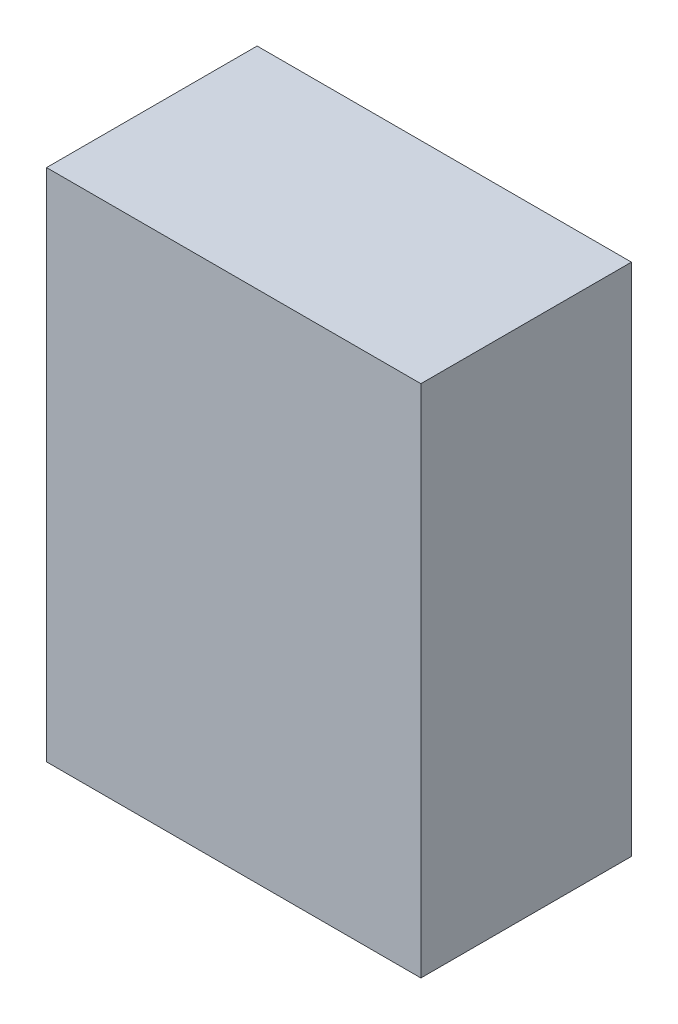
ISO-10303-21;
HEADER;
FILE_DESCRIPTION(('STEP AP214'),'2;1');
FILE_NAME('part.step','',(''),(''),'','','');
FILE_SCHEMA(('AUTOMOTIVE_DESIGN { 1 0 10303 214 1 1 1 1 }'));
ENDSEC;
DATA;
#1=APPLICATION_CONTEXT('core data for automotive mechanical design processes');
#2=APPLICATION_PROTOCOL_DEFINITION('international standard','automotive_design',2000,#1);
#3=PRODUCT_CONTEXT('',#1,'mechanical');
#4=PRODUCT('Part','Part','',(#3));
#5=PRODUCT_RELATED_PRODUCT_CATEGORY('part','',(#4));
#6=PRODUCT_DEFINITION_FORMATION('','',#4);
#7=PRODUCT_DEFINITION_CONTEXT('part definition',#1,'design');
#8=PRODUCT_DEFINITION('design','',#6,#7);
#9=PRODUCT_DEFINITION_SHAPE('','',#8);
#10=(LENGTH_UNIT() NAMED_UNIT(*) SI_UNIT(.MILLI.,.METRE.));
#11=(NAMED_UNIT(*) PLANE_ANGLE_UNIT() SI_UNIT($,.RADIAN.));
#12=(NAMED_UNIT(*) SI_UNIT($,.STERADIAN.) SOLID_ANGLE_UNIT());
#13=UNCERTAINTY_MEASURE_WITH_UNIT(LENGTH_MEASURE(1.E-05),#10,'distance_accuracy_value','');
#14=(GEOMETRIC_REPRESENTATION_CONTEXT(3) GLOBAL_UNCERTAINTY_ASSIGNED_CONTEXT((#13)) GLOBAL_UNIT_ASSIGNED_CONTEXT((#10,
#11,#12)) REPRESENTATION_CONTEXT('',''));
#15=CARTESIAN_POINT('',(0.,0.,0.));
#16=DIRECTION('',(0.,0.,1.));
#17=DIRECTION('',(1.,0.,0.));
#18=AXIS2_PLACEMENT_3D('',#15,#16,#17);
#19=CARTESIAN_POINT('',(0.80000094,-1.10000034,0.90000074));
#20=DIRECTION('',(0.,0.,-1.));
#21=DIRECTION('',(-1.,0.,0.));
#22=AXIS2_PLACEMENT_3D('',#19,#20,#21);
#23=PLANE('',#22);
#24=DIRECTION('',(1.,0.,0.));
#25=VECTOR('',#24,1.);
#26=CARTESIAN_POINT('',(0.80000094,1.10000034,0.90000074));
#27=LINE('',#26,#25);
#28=CARTESIAN_POINT('',(0.80000094,1.10000034,0.90000074));
#29=VERTEX_POINT('',#28);
#30=CARTESIAN_POINT('',(-0.80000094,1.10000034,0.90000074));
#31=VERTEX_POINT('',#30);
#32=EDGE_CURVE('E55',#29,#31,#27,.F.);
#33=ORIENTED_EDGE('',*,*,#32,.T.);
#34=DIRECTION('',(0.,1.,0.));
#35=VECTOR('',#34,1.);
#36=CARTESIAN_POINT('',(-0.80000094,1.10000034,0.90000074));
#37=LINE('',#36,#35);
#38=CARTESIAN_POINT('',(-0.80000094,-1.10000034,0.90000074));
#39=VERTEX_POINT('',#38);
#40=EDGE_CURVE('E57',#31,#39,#37,.F.);
#41=ORIENTED_EDGE('',*,*,#40,.T.);
#42=DIRECTION('',(1.,0.,0.));
#43=VECTOR('',#42,1.);
#44=CARTESIAN_POINT('',(-0.80000094,-1.10000034,0.90000074));
#45=LINE('',#44,#43);
#46=CARTESIAN_POINT('',(0.80000094,-1.10000034,0.90000074));
#47=VERTEX_POINT('',#46);
#48=EDGE_CURVE('E20',#39,#47,#45,.T.);
#49=ORIENTED_EDGE('',*,*,#48,.T.);
#50=DIRECTION('',(0.,1.,0.));
#51=VECTOR('',#50,1.);
#52=CARTESIAN_POINT('',(0.80000094,-1.10000034,0.90000074));
#53=LINE('',#52,#51);
#54=EDGE_CURVE('E80',#47,#29,#53,.T.);
#55=ORIENTED_EDGE('',*,*,#54,.T.);
#56=EDGE_LOOP('',(#33,#41,#49,#55));
#57=FACE_BOUND('',#56,.T.);
#58=ADVANCED_FACE('F17',(#57),#23,.F.);
#59=CARTESIAN_POINT('',(-0.80000094,-1.10000034,0.));
#60=DIRECTION('',(0.,1.,0.));
#61=DIRECTION('',(0.,0.,1.));
#62=AXIS2_PLACEMENT_3D('',#59,#60,#61);
#63=PLANE('',#62);
#64=DIRECTION('',(0.,0.,1.));
#65=VECTOR('',#64,1.);
#66=CARTESIAN_POINT('',(0.80000094,-1.10000034,0.));
#67=LINE('',#66,#65);
#68=CARTESIAN_POINT('',(0.80000094,-1.10000034,0.));
#69=VERTEX_POINT('',#68);
#70=EDGE_CURVE('E68',#69,#47,#67,.T.);
#71=ORIENTED_EDGE('',*,*,#70,.T.);
#72=ORIENTED_EDGE('',*,*,#48,.F.);
#73=DIRECTION('',(0.,0.,-1.));
#74=VECTOR('',#73,1.);
#75=CARTESIAN_POINT('',(-0.80000094,-1.10000034,0.));
#76=LINE('',#75,#74);
#77=CARTESIAN_POINT('',(-0.80000094,-1.10000034,0.));
#78=VERTEX_POINT('',#77);
#79=EDGE_CURVE('E63',#39,#78,#76,.T.);
#80=ORIENTED_EDGE('',*,*,#79,.T.);
#81=DIRECTION('',(-1.,0.,0.));
#82=VECTOR('',#81,1.);
#83=CARTESIAN_POINT('',(0.80000094,-1.10000034,0.));
#84=LINE('',#83,#82);
#85=EDGE_CURVE('E83',#69,#78,#84,.T.);
#86=ORIENTED_EDGE('',*,*,#85,.F.);
#87=EDGE_LOOP('',(#71,#72,#80,#86));
#88=FACE_BOUND('',#87,.T.);
#89=ADVANCED_FACE('F65',(#88),#63,.F.);
#90=CARTESIAN_POINT('',(-0.80000094,1.10000034,0.));
#91=DIRECTION('',(1.,0.,0.));
#92=DIRECTION('',(0.,0.,-1.));
#93=AXIS2_PLACEMENT_3D('',#90,#91,#92);
#94=PLANE('',#93);
#95=ORIENTED_EDGE('',*,*,#79,.F.);
#96=ORIENTED_EDGE('',*,*,#40,.F.);
#97=DIRECTION('',(0.,0.,-1.));
#98=VECTOR('',#97,1.);
#99=CARTESIAN_POINT('',(-0.80000094,1.10000034,0.));
#100=LINE('',#99,#98);
#101=CARTESIAN_POINT('',(-0.80000094,1.10000034,0.));
#102=VERTEX_POINT('',#101);
#103=EDGE_CURVE('E75',#31,#102,#100,.T.);
#104=ORIENTED_EDGE('',*,*,#103,.T.);
#105=DIRECTION('',(0.,1.,0.));
#106=VECTOR('',#105,1.);
#107=CARTESIAN_POINT('',(-0.80000094,-1.10000034,0.));
#108=LINE('',#107,#106);
#109=EDGE_CURVE('E72',#78,#102,#108,.T.);
#110=ORIENTED_EDGE('',*,*,#109,.F.);
#111=EDGE_LOOP('',(#95,#96,#104,#110));
#112=FACE_BOUND('',#111,.T.);
#113=ADVANCED_FACE('F70',(#112),#94,.F.);
#114=CARTESIAN_POINT('',(0.80000094,1.10000034,0.));
#115=DIRECTION('',(0.,-1.,0.));
#116=DIRECTION('',(0.,0.,-1.));
#117=AXIS2_PLACEMENT_3D('',#114,#115,#116);
#118=PLANE('',#117);
#119=ORIENTED_EDGE('',*,*,#103,.F.);
#120=ORIENTED_EDGE('',*,*,#32,.F.);
#121=DIRECTION('',(0.,0.,1.));
#122=VECTOR('',#121,1.);
#123=CARTESIAN_POINT('',(0.80000094,1.10000034,0.));
#124=LINE('',#123,#122);
#125=CARTESIAN_POINT('',(0.80000094,1.10000034,0.));
#126=VERTEX_POINT('',#125);
#127=EDGE_CURVE('E35',#29,#126,#124,.F.);
#128=ORIENTED_EDGE('',*,*,#127,.T.);
#129=DIRECTION('',(-1.,0.,0.));
#130=VECTOR('',#129,1.);
#131=CARTESIAN_POINT('',(0.80000094,1.10000034,0.));
#132=LINE('',#131,#130);
#133=EDGE_CURVE('E26',#102,#126,#132,.F.);
#134=ORIENTED_EDGE('',*,*,#133,.F.);
#135=EDGE_LOOP('',(#119,#120,#128,#134));
#136=FACE_BOUND('',#135,.T.);
#137=ADVANCED_FACE('F89',(#136),#118,.F.);
#138=CARTESIAN_POINT('',(0.80000094,-1.10000034,0.));
#139=DIRECTION('',(-1.,0.,0.));
#140=DIRECTION('',(0.,0.,1.));
#141=AXIS2_PLACEMENT_3D('',#138,#139,#140);
#142=PLANE('',#141);
#143=ORIENTED_EDGE('',*,*,#127,.F.);
#144=ORIENTED_EDGE('',*,*,#54,.F.);
#145=ORIENTED_EDGE('',*,*,#70,.F.);
#146=DIRECTION('',(0.,1.,0.));
#147=VECTOR('',#146,1.);
#148=CARTESIAN_POINT('',(0.80000094,-1.10000034,0.));
#149=LINE('',#148,#147);
#150=EDGE_CURVE('E11',#126,#69,#149,.F.);
#151=ORIENTED_EDGE('',*,*,#150,.F.);
#152=EDGE_LOOP('',(#143,#144,#145,#151));
#153=FACE_BOUND('',#152,.T.);
#154=ADVANCED_FACE('F91',(#153),#142,.F.);
#155=CARTESIAN_POINT('',(0.80000094,-1.10000034,0.));
#156=DIRECTION('',(0.,0.,-1.));
#157=DIRECTION('',(-1.,0.,0.));
#158=AXIS2_PLACEMENT_3D('',#155,#156,#157);
#159=PLANE('',#158);
#160=ORIENTED_EDGE('',*,*,#133,.T.);
#161=ORIENTED_EDGE('',*,*,#150,.T.);
#162=ORIENTED_EDGE('',*,*,#85,.T.);
#163=ORIENTED_EDGE('',*,*,#109,.T.);
#164=EDGE_LOOP('',(#160,#161,#162,#163));
#165=FACE_BOUND('',#164,.T.);
#166=ADVANCED_FACE('F88',(#165),#159,.T.);
#167=CLOSED_SHELL('',(#58,#89,#113,#137,#154,#166));
#168=MANIFOLD_SOLID_BREP('B1',#167);
#169=ADVANCED_BREP_SHAPE_REPRESENTATION('',(#18,#168),#14);
#170=SHAPE_DEFINITION_REPRESENTATION(#9,#169);
ENDSEC;
END-ISO-10303-21;
